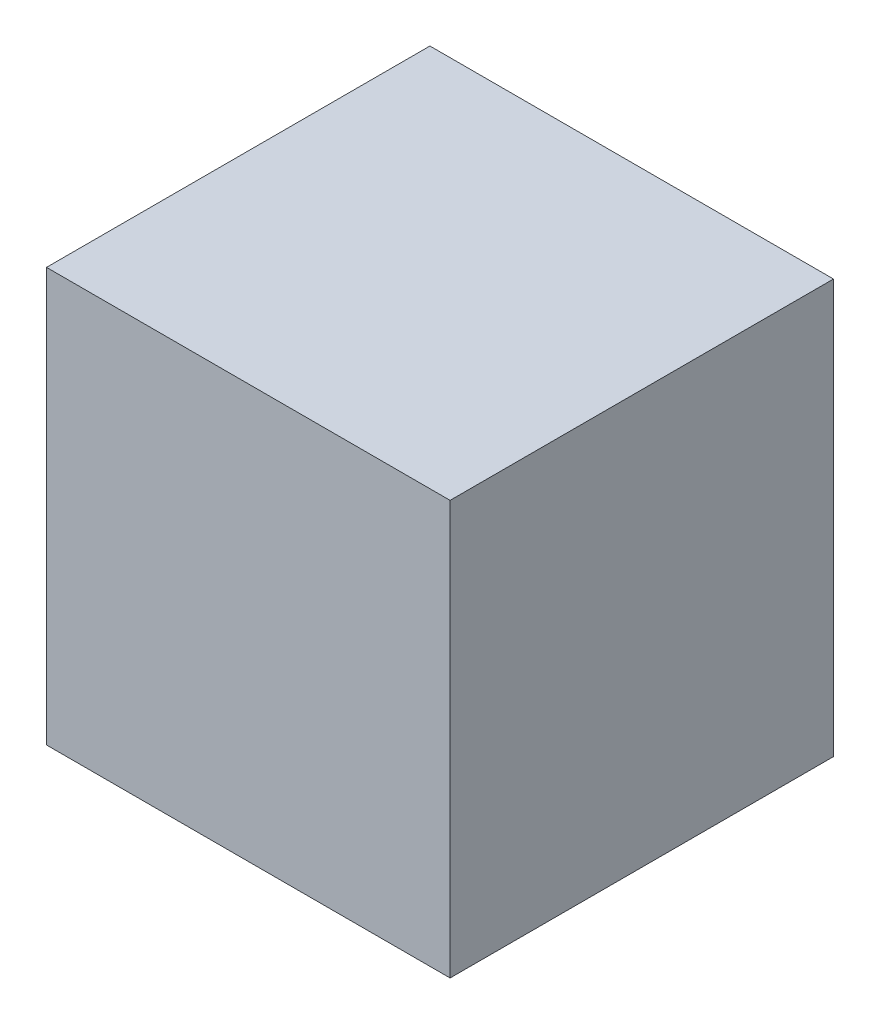
ISO-10303-21;
HEADER;
FILE_DESCRIPTION(('STEP AP214'),'2;1');
FILE_NAME('part.step','',(''),(''),'','','');
FILE_SCHEMA(('AUTOMOTIVE_DESIGN { 1 0 10303 214 1 1 1 1 }'));
ENDSEC;
DATA;
#1=APPLICATION_CONTEXT('core data for automotive mechanical design processes');
#2=APPLICATION_PROTOCOL_DEFINITION('international standard','automotive_design',2000,#1);
#3=PRODUCT_CONTEXT('',#1,'mechanical');
#4=PRODUCT('Part','Part','',(#3));
#5=PRODUCT_RELATED_PRODUCT_CATEGORY('part','',(#4));
#6=PRODUCT_DEFINITION_FORMATION('','',#4);
#7=PRODUCT_DEFINITION_CONTEXT('part definition',#1,'design');
#8=PRODUCT_DEFINITION('design','',#6,#7);
#9=PRODUCT_DEFINITION_SHAPE('','',#8);
#10=(LENGTH_UNIT() NAMED_UNIT(*) SI_UNIT(.MILLI.,.METRE.));
#11=(NAMED_UNIT(*) PLANE_ANGLE_UNIT() SI_UNIT($,.RADIAN.));
#12=(NAMED_UNIT(*) SI_UNIT($,.STERADIAN.) SOLID_ANGLE_UNIT());
#13=UNCERTAINTY_MEASURE_WITH_UNIT(LENGTH_MEASURE(1.E-05),#10,'distance_accuracy_value','');
#14=(GEOMETRIC_REPRESENTATION_CONTEXT(3) GLOBAL_UNCERTAINTY_ASSIGNED_CONTEXT((#13)) GLOBAL_UNIT_ASSIGNED_CONTEXT((#10,
#11,#12)) REPRESENTATION_CONTEXT('',''));
#15=CARTESIAN_POINT('',(0.,0.,0.));
#16=DIRECTION('',(0.,0.,1.));
#17=DIRECTION('',(1.,0.,0.));
#18=AXIS2_PLACEMENT_3D('',#15,#16,#17);
#19=CARTESIAN_POINT('',(-20.,41.,-19.));
#20=DIRECTION('',(0.,0.,-1.));
#21=DIRECTION('',(-1.,0.,0.));
#22=AXIS2_PLACEMENT_3D('',#19,#20,#21);
#23=PLANE('',#22);
#24=DIRECTION('',(1.,0.,0.));
#25=VECTOR('',#24,1.);
#26=CARTESIAN_POINT('',(-20.,0.,-19.));
#27=LINE('',#26,#25);
#28=CARTESIAN_POINT('',(-20.,0.,-19.));
#29=VERTEX_POINT('',#28);
#30=CARTESIAN_POINT('',(20.,0.,-19.));
#31=VERTEX_POINT('',#30);
#32=EDGE_CURVE('E113',#29,#31,#27,.T.);
#33=ORIENTED_EDGE('',*,*,#32,.F.);
#34=DIRECTION('',(0.,-1.,0.));
#35=VECTOR('',#34,1.);
#36=CARTESIAN_POINT('',(-20.,41.,-19.));
#37=LINE('',#36,#35);
#38=CARTESIAN_POINT('',(-20.,41.,-19.));
#39=VERTEX_POINT('',#38);
#40=EDGE_CURVE('E11',#39,#29,#37,.T.);
#41=ORIENTED_EDGE('',*,*,#40,.F.);
#42=DIRECTION('',(1.,0.,0.));
#43=VECTOR('',#42,1.);
#44=CARTESIAN_POINT('',(-20.,41.,-19.));
#45=LINE('',#44,#43);
#46=CARTESIAN_POINT('',(20.,41.,-19.));
#47=VERTEX_POINT('',#46);
#48=EDGE_CURVE('E105',#39,#47,#45,.T.);
#49=ORIENTED_EDGE('',*,*,#48,.T.);
#50=DIRECTION('',(0.,-1.,0.));
#51=VECTOR('',#50,1.);
#52=CARTESIAN_POINT('',(20.,41.,-19.));
#53=LINE('',#52,#51);
#54=EDGE_CURVE('E46',#47,#31,#53,.T.);
#55=ORIENTED_EDGE('',*,*,#54,.T.);
#56=EDGE_LOOP('',(#33,#41,#49,#55));
#57=FACE_BOUND('',#56,.T.);
#58=ADVANCED_FACE('F43',(#57),#23,.T.);
#59=CARTESIAN_POINT('',(-20.,41.,19.));
#60=DIRECTION('',(-1.,0.,0.));
#61=DIRECTION('',(0.,0.,1.));
#62=AXIS2_PLACEMENT_3D('',#59,#60,#61);
#63=PLANE('',#62);
#64=DIRECTION('',(0.,0.,-1.));
#65=VECTOR('',#64,1.);
#66=CARTESIAN_POINT('',(-20.,0.,19.));
#67=LINE('',#66,#65);
#68=CARTESIAN_POINT('',(-20.,0.,19.));
#69=VERTEX_POINT('',#68);
#70=EDGE_CURVE('E108',#69,#29,#67,.T.);
#71=ORIENTED_EDGE('',*,*,#70,.F.);
#72=DIRECTION('',(0.,-1.,0.));
#73=VECTOR('',#72,1.);
#74=CARTESIAN_POINT('',(-20.,41.,19.));
#75=LINE('',#74,#73);
#76=CARTESIAN_POINT('',(-20.,41.,19.));
#77=VERTEX_POINT('',#76);
#78=EDGE_CURVE('E53',#77,#69,#75,.T.);
#79=ORIENTED_EDGE('',*,*,#78,.F.);
#80=DIRECTION('',(0.,0.,-1.));
#81=VECTOR('',#80,1.);
#82=CARTESIAN_POINT('',(-20.,41.,19.));
#83=LINE('',#82,#81);
#84=EDGE_CURVE('E92',#77,#39,#83,.T.);
#85=ORIENTED_EDGE('',*,*,#84,.T.);
#86=ORIENTED_EDGE('',*,*,#40,.T.);
#87=EDGE_LOOP('',(#71,#79,#85,#86));
#88=FACE_BOUND('',#87,.T.);
#89=ADVANCED_FACE('F129',(#88),#63,.T.);
#90=CARTESIAN_POINT('',(-20.,41.,19.));
#91=DIRECTION('',(0.,0.,-1.));
#92=DIRECTION('',(-1.,0.,0.));
#93=AXIS2_PLACEMENT_3D('',#90,#91,#92);
#94=PLANE('',#93);
#95=DIRECTION('',(1.,0.,0.));
#96=VECTOR('',#95,1.);
#97=CARTESIAN_POINT('',(-20.,0.,19.));
#98=LINE('',#97,#96);
#99=CARTESIAN_POINT('',(20.,0.,19.));
#100=VERTEX_POINT('',#99);
#101=EDGE_CURVE('E98',#69,#100,#98,.T.);
#102=ORIENTED_EDGE('',*,*,#101,.T.);
#103=DIRECTION('',(0.,-1.,0.));
#104=VECTOR('',#103,1.);
#105=CARTESIAN_POINT('',(20.,41.,19.));
#106=LINE('',#105,#104);
#107=CARTESIAN_POINT('',(20.,41.,19.));
#108=VERTEX_POINT('',#107);
#109=EDGE_CURVE('E96',#108,#100,#106,.T.);
#110=ORIENTED_EDGE('',*,*,#109,.F.);
#111=DIRECTION('',(1.,0.,0.));
#112=VECTOR('',#111,1.);
#113=CARTESIAN_POINT('',(-20.,41.,19.));
#114=LINE('',#113,#112);
#115=EDGE_CURVE('E89',#77,#108,#114,.T.);
#116=ORIENTED_EDGE('',*,*,#115,.F.);
#117=ORIENTED_EDGE('',*,*,#78,.T.);
#118=EDGE_LOOP('',(#102,#110,#116,#117));
#119=FACE_BOUND('',#118,.T.);
#120=ADVANCED_FACE('F97',(#119),#94,.F.);
#121=CARTESIAN_POINT('',(20.,41.,19.));
#122=DIRECTION('',(-1.,0.,0.));
#123=DIRECTION('',(0.,0.,1.));
#124=AXIS2_PLACEMENT_3D('',#121,#122,#123);
#125=PLANE('',#124);
#126=DIRECTION('',(0.,0.,-1.));
#127=VECTOR('',#126,1.);
#128=CARTESIAN_POINT('',(20.,0.,19.));
#129=LINE('',#128,#127);
#130=EDGE_CURVE('E117',#100,#31,#129,.T.);
#131=ORIENTED_EDGE('',*,*,#130,.T.);
#132=ORIENTED_EDGE('',*,*,#54,.F.);
#133=DIRECTION('',(0.,0.,-1.));
#134=VECTOR('',#133,1.);
#135=CARTESIAN_POINT('',(20.,41.,19.));
#136=LINE('',#135,#134);
#137=EDGE_CURVE('E86',#108,#47,#136,.T.);
#138=ORIENTED_EDGE('',*,*,#137,.F.);
#139=ORIENTED_EDGE('',*,*,#109,.T.);
#140=EDGE_LOOP('',(#131,#132,#138,#139));
#141=FACE_BOUND('',#140,.T.);
#142=ADVANCED_FACE('F103',(#141),#125,.F.);
#143=CARTESIAN_POINT('',(0.,41.,0.));
#144=DIRECTION('',(0.,1.,0.));
#145=DIRECTION('',(0.,0.,1.));
#146=AXIS2_PLACEMENT_3D('',#143,#144,#145);
#147=PLANE('',#146);
#148=ORIENTED_EDGE('',*,*,#48,.F.);
#149=ORIENTED_EDGE('',*,*,#84,.F.);
#150=ORIENTED_EDGE('',*,*,#115,.T.);
#151=ORIENTED_EDGE('',*,*,#137,.T.);
#152=EDGE_LOOP('',(#148,#149,#150,#151));
#153=FACE_BOUND('',#152,.T.);
#154=ADVANCED_FACE('F91',(#153),#147,.T.);
#155=CARTESIAN_POINT('',(0.,0.,0.));
#156=DIRECTION('',(0.,1.,0.));
#157=DIRECTION('',(0.,0.,1.));
#158=AXIS2_PLACEMENT_3D('',#155,#156,#157);
#159=PLANE('',#158);
#160=ORIENTED_EDGE('',*,*,#32,.T.);
#161=ORIENTED_EDGE('',*,*,#130,.F.);
#162=ORIENTED_EDGE('',*,*,#101,.F.);
#163=ORIENTED_EDGE('',*,*,#70,.T.);
#164=EDGE_LOOP('',(#160,#161,#162,#163));
#165=FACE_BOUND('',#164,.T.);
#166=ADVANCED_FACE('F128',(#165),#159,.F.);
#167=CLOSED_SHELL('',(#58,#89,#120,#142,#154,#166));
#168=MANIFOLD_SOLID_BREP('B2',#167);
#169=ADVANCED_BREP_SHAPE_REPRESENTATION('',(#18,#168),#14);
#170=SHAPE_DEFINITION_REPRESENTATION(#9,#169);
ENDSEC;
END-ISO-10303-21;
